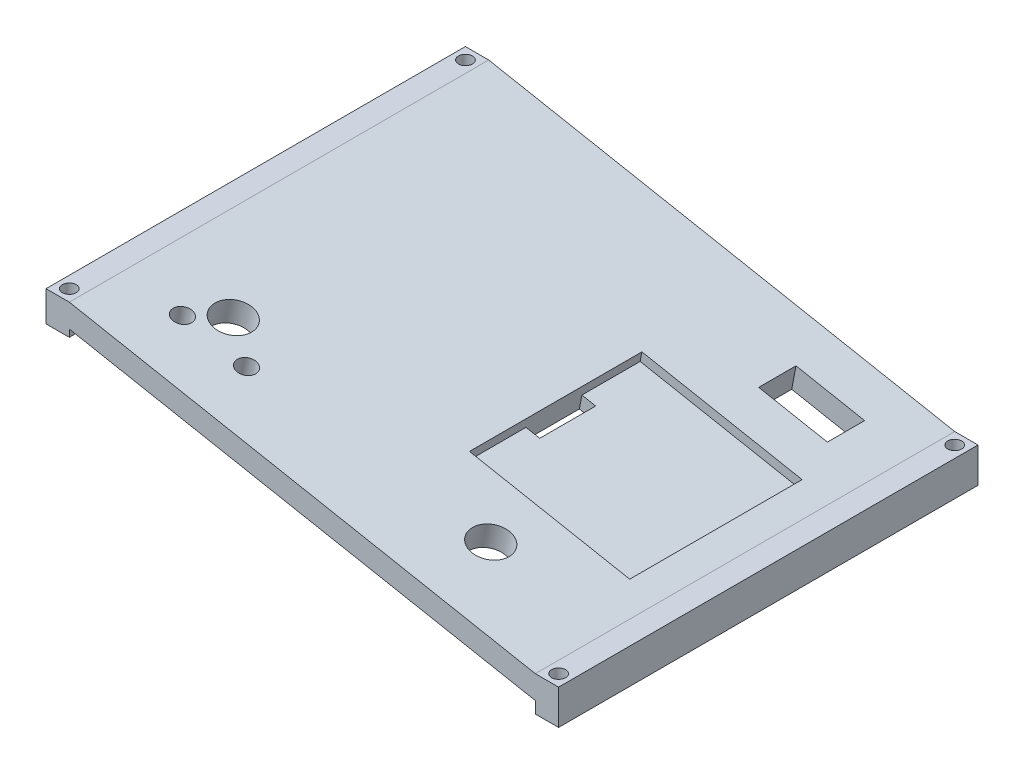
ISO-10303-21;
HEADER;
FILE_DESCRIPTION(('STEP AP214'),'2;1');
FILE_NAME('part.step','',(''),(''),'','','');
FILE_SCHEMA(('AUTOMOTIVE_DESIGN { 1 0 10303 214 1 1 1 1 }'));
ENDSEC;
DATA;
#1=APPLICATION_CONTEXT('core data for automotive mechanical design processes');
#2=APPLICATION_PROTOCOL_DEFINITION('international standard','automotive_design',2000,#1);
#3=PRODUCT_CONTEXT('',#1,'mechanical');
#4=PRODUCT('Part','Part','',(#3));
#5=PRODUCT_RELATED_PRODUCT_CATEGORY('part','',(#4));
#6=PRODUCT_DEFINITION_FORMATION('','',#4);
#7=PRODUCT_DEFINITION_CONTEXT('part definition',#1,'design');
#8=PRODUCT_DEFINITION('design','',#6,#7);
#9=PRODUCT_DEFINITION_SHAPE('','',#8);
#10=(LENGTH_UNIT() NAMED_UNIT(*) SI_UNIT(.MILLI.,.METRE.));
#11=(NAMED_UNIT(*) PLANE_ANGLE_UNIT() SI_UNIT($,.RADIAN.));
#12=(NAMED_UNIT(*) SI_UNIT($,.STERADIAN.) SOLID_ANGLE_UNIT());
#13=UNCERTAINTY_MEASURE_WITH_UNIT(LENGTH_MEASURE(1.E-05),#10,'distance_accuracy_value','');
#14=(GEOMETRIC_REPRESENTATION_CONTEXT(3) GLOBAL_UNCERTAINTY_ASSIGNED_CONTEXT((#13)) GLOBAL_UNIT_ASSIGNED_CONTEXT((#10,
#11,#12)) REPRESENTATION_CONTEXT('',''));
#15=CARTESIAN_POINT('',(0.,0.,0.));
#16=DIRECTION('',(0.,0.,1.));
#17=DIRECTION('',(1.,0.,0.));
#18=AXIS2_PLACEMENT_3D('',#15,#16,#17);
#19=CARTESIAN_POINT('',(3.12910284463895,16.4277899343545,-45.));
#20=DIRECTION('',(-0.187112107889995,-0.982338566422475,0.));
#21=DIRECTION('',(0.982338566422475,-0.187112107889995,0.));
#22=AXIS2_PLACEMENT_3D('',#19,#20,#21);
#23=PLANE('',#22);
#24=DIRECTION('',(0.982338566422475,-0.187112107889995,0.));
#25=VECTOR('',#24,1.);
#26=CARTESIAN_POINT('',(25.4415358394381,12.1778026972499,-27.5));
#27=LINE('',#26,#25);
#28=CARTESIAN_POINT('',(25.4415358394381,12.1778026972499,-27.5));
#29=VERTEX_POINT('',#28);
#30=CARTESIAN_POINT('',(40.1766143357753,9.37112107889996,-27.5));
#31=VERTEX_POINT('',#30);
#32=EDGE_CURVE('E232',#29,#31,#27,.T.);
#33=ORIENTED_EDGE('',*,*,#32,.F.);
#34=DIRECTION('',(0.,0.,1.));
#35=VECTOR('',#34,1.);
#36=CARTESIAN_POINT('',(25.4415358394381,12.1778026972499,-27.5));
#37=LINE('',#36,#35);
#38=CARTESIAN_POINT('',(25.4415358394381,12.1778026972499,-35.5));
#39=VERTEX_POINT('',#38);
#40=EDGE_CURVE('E87',#39,#29,#37,.T.);
#41=ORIENTED_EDGE('',*,*,#40,.F.);
#42=DIRECTION('',(-0.982338566422475,0.187112107889995,0.));
#43=VECTOR('',#42,1.);
#44=CARTESIAN_POINT('',(25.4415358394381,12.1778026972499,-35.5));
#45=LINE('',#44,#43);
#46=CARTESIAN_POINT('',(40.1766143357753,9.37112107889996,-35.5));
#47=VERTEX_POINT('',#46);
#48=EDGE_CURVE('E238',#47,#39,#45,.T.);
#49=ORIENTED_EDGE('',*,*,#48,.F.);
#50=DIRECTION('',(0.,0.,-1.));
#51=VECTOR('',#50,1.);
#52=CARTESIAN_POINT('',(40.1766143357753,9.37112107889996,-27.5));
#53=LINE('',#52,#51);
#54=EDGE_CURVE('E223',#31,#47,#53,.T.);
#55=ORIENTED_EDGE('',*,*,#54,.F.);
#56=EDGE_LOOP('',(#33,#41,#49,#55));
#57=FACE_BOUND('',#56,.T.);
#58=CARTESIAN_POINT('',(25.4415358394381,12.1778026972499,30.));
#59=DIRECTION('',(0.187112107889995,0.982338566422475,0.));
#60=DIRECTION('',(-0.982338566422475,0.187112107889995,0.));
#61=AXIS2_PLACEMENT_3D('',#58,#59,#60);
#62=CIRCLE('',#61,4.);
#63=CARTESIAN_POINT('',(21.5121815737482,12.9262511288099,30.));
#64=VERTEX_POINT('',#63);
#65=EDGE_CURVE('E245',#64,#64,#62,.T.);
#66=ORIENTED_EDGE('',*,*,#65,.F.);
#67=EDGE_LOOP('',(#66));
#68=FACE_BOUND('',#67,.T.);
#69=CARTESIAN_POINT('',(-23.9680279898044,21.5891481885342,33.));
#70=DIRECTION('',(0.187112107889995,0.982338566422475,0.));
#71=DIRECTION('',(-0.982338566422475,0.187112107889995,0.));
#72=AXIS2_PLACEMENT_3D('',#69,#70,#71);
#73=CIRCLE('',#72,2.);
#74=CARTESIAN_POINT('',(-25.9327051226494,21.9633724043142,33.));
#75=VERTEX_POINT('',#74);
#76=EDGE_CURVE('E255',#75,#75,#73,.T.);
#77=ORIENTED_EDGE('',*,*,#76,.F.);
#78=EDGE_LOOP('',(#77));
#79=FACE_BOUND('',#78,.T.);
#80=CARTESIAN_POINT('',(-32.8090750876067,23.2731571595441,27.));
#81=DIRECTION('',(0.187112107889995,0.982338566422475,0.));
#82=DIRECTION('',(-0.982338566422475,0.187112107889995,0.));
#83=AXIS2_PLACEMENT_3D('',#80,#81,#82);
#84=CIRCLE('',#83,4.);
#85=CARTESIAN_POINT('',(-36.7384293532966,24.0216055911041,27.));
#86=VERTEX_POINT('',#85);
#87=EDGE_CURVE('E251',#86,#86,#84,.T.);
#88=ORIENTED_EDGE('',*,*,#87,.F.);
#89=EDGE_LOOP('',(#88));
#90=FACE_BOUND('',#89,.T.);
#91=CARTESIAN_POINT('',(-37.7207679197191,24.2087176989941,33.));
#92=DIRECTION('',(0.187112107889995,0.982338566422475,0.));
#93=DIRECTION('',(-0.982338566422475,0.187112107889995,0.));
#94=AXIS2_PLACEMENT_3D('',#91,#92,#93);
#95=CIRCLE('',#94,2.);
#96=CARTESIAN_POINT('',(-39.685445052564,24.5829419147741,33.));
#97=VERTEX_POINT('',#96);
#98=EDGE_CURVE('E254',#97,#97,#95,.T.);
#99=ORIENTED_EDGE('',*,*,#98,.F.);
#100=EDGE_LOOP('',(#99));
#101=FACE_BOUND('',#100,.T.);
#102=DIRECTION('',(0.982338566422475,-0.187112107889995,0.));
#103=VECTOR('',#102,1.);
#104=CARTESIAN_POINT('',(3.12910284463895,16.4277899343545,45.));
#105=LINE('',#104,#103);
#106=CARTESIAN_POINT('',(-50.,26.547619047619,45.));
#107=VERTEX_POINT('',#106);
#108=CARTESIAN_POINT('',(50.,7.5,45.));
#109=VERTEX_POINT('',#108);
#110=EDGE_CURVE('E351',#107,#109,#105,.T.);
#111=ORIENTED_EDGE('',*,*,#110,.T.);
#112=DIRECTION('',(0.,0.,1.));
#113=VECTOR('',#112,1.);
#114=CARTESIAN_POINT('',(50.,7.5,-45.));
#115=LINE('',#114,#113);
#116=CARTESIAN_POINT('',(50.,7.5,-45.));
#117=VERTEX_POINT('',#116);
#118=EDGE_CURVE('E364',#117,#109,#115,.T.);
#119=ORIENTED_EDGE('',*,*,#118,.F.);
#120=DIRECTION('',(0.982338566422475,-0.187112107889995,0.));
#121=VECTOR('',#120,1.);
#122=CARTESIAN_POINT('',(3.12910284463895,16.4277899343545,-45.));
#123=LINE('',#122,#121);
#124=CARTESIAN_POINT('',(-50.,26.547619047619,-45.));
#125=VERTEX_POINT('',#124);
#126=EDGE_CURVE('E353',#125,#117,#123,.T.);
#127=ORIENTED_EDGE('',*,*,#126,.F.);
#128=DIRECTION('',(0.,0.,1.));
#129=VECTOR('',#128,1.);
#130=CARTESIAN_POINT('',(-50.,26.547619047619,-45.));
#131=LINE('',#130,#129);
#132=EDGE_CURVE('E367',#125,#107,#131,.T.);
#133=ORIENTED_EDGE('',*,*,#132,.T.);
#134=EDGE_LOOP('',(#111,#119,#127,#133));
#135=FACE_BOUND('',#134,.T.);
#136=DIRECTION('',(0.,0.,-1.));
#137=VECTOR('',#136,1.);
#138=CARTESIAN_POINT('',(9.37362650992617,15.2383568552522,0.));
#139=LINE('',#138,#137);
#140=CARTESIAN_POINT('',(9.37362650992617,15.2383568552522,18.5));
#141=VERTEX_POINT('',#140);
#142=CARTESIAN_POINT('',(9.37362650992617,15.2383568552522,-18.5));
#143=VERTEX_POINT('',#142);
#144=EDGE_CURVE('E289',#141,#143,#139,.T.);
#145=ORIENTED_EDGE('',*,*,#144,.T.);
#146=DIRECTION('',(0.982338566422475,-0.187112107889995,0.));
#147=VECTOR('',#146,1.);
#148=CARTESIAN_POINT('',(3.12910284463895,16.4277899343545,-18.5));
#149=LINE('',#148,#147);
#150=CARTESIAN_POINT('',(43.7554763347128,8.68943307910234,-18.5));
#151=VERTEX_POINT('',#150);
#152=EDGE_CURVE('E308',#143,#151,#149,.T.);
#153=ORIENTED_EDGE('',*,*,#152,.T.);
#154=DIRECTION('',(0.,0.,1.));
#155=VECTOR('',#154,1.);
#156=CARTESIAN_POINT('',(43.7554763347128,8.68943307910234,0.));
#157=LINE('',#156,#155);
#158=CARTESIAN_POINT('',(43.7554763347128,8.68943307910233,18.5));
#159=VERTEX_POINT('',#158);
#160=EDGE_CURVE('E305',#151,#159,#157,.T.);
#161=ORIENTED_EDGE('',*,*,#160,.T.);
#162=DIRECTION('',(-0.982338566422475,0.187112107889995,0.));
#163=VECTOR('',#162,1.);
#164=CARTESIAN_POINT('',(3.12910284463895,16.4277899343545,18.5));
#165=LINE('',#164,#163);
#166=EDGE_CURVE('E284',#159,#141,#165,.T.);
#167=ORIENTED_EDGE('',*,*,#166,.T.);
#168=EDGE_LOOP('',(#145,#153,#161,#167));
#169=FACE_BOUND('',#168,.T.);
#170=ADVANCED_FACE('F72',(#57,#68,#79,#90,#101,#135,#169),#23,.F.);
#171=CARTESIAN_POINT('',(2.21006564551422,11.6028446389497,-45.));
#172=DIRECTION('',(-0.187112107889995,-0.982338566422475,0.));
#173=DIRECTION('',(0.982338566422475,-0.187112107889995,0.));
#174=AXIS2_PLACEMENT_3D('',#171,#172,#173);
#175=PLANE('',#174);
#176=DIRECTION('',(0.,0.,-1.));
#177=VECTOR('',#176,1.);
#178=CARTESIAN_POINT('',(24.5224986403134,7.35285740184506,-45.));
#179=LINE('',#178,#177);
#180=CARTESIAN_POINT('',(24.5224986403134,7.35285740184506,-27.5));
#181=VERTEX_POINT('',#180);
#182=CARTESIAN_POINT('',(24.5224986403134,7.35285740184506,-35.5));
#183=VERTEX_POINT('',#182);
#184=EDGE_CURVE('E12',#181,#183,#179,.T.);
#185=ORIENTED_EDGE('',*,*,#184,.F.);
#186=DIRECTION('',(-0.982338566422475,0.187112107889995,0.));
#187=VECTOR('',#186,1.);
#188=CARTESIAN_POINT('',(2.21006564551422,11.6028446389497,-27.5));
#189=LINE('',#188,#187);
#190=CARTESIAN_POINT('',(39.2575771366505,4.54617578349514,-27.5));
#191=VERTEX_POINT('',#190);
#192=EDGE_CURVE('E424',#191,#181,#189,.T.);
#193=ORIENTED_EDGE('',*,*,#192,.F.);
#194=DIRECTION('',(0.,0.,1.));
#195=VECTOR('',#194,1.);
#196=CARTESIAN_POINT('',(39.2575771366505,4.54617578349514,-45.));
#197=LINE('',#196,#195);
#198=CARTESIAN_POINT('',(39.2575771366505,4.54617578349514,-35.5));
#199=VERTEX_POINT('',#198);
#200=EDGE_CURVE('E226',#199,#191,#197,.T.);
#201=ORIENTED_EDGE('',*,*,#200,.F.);
#202=DIRECTION('',(0.982338566422475,-0.187112107889995,0.));
#203=VECTOR('',#202,1.);
#204=CARTESIAN_POINT('',(2.21006564551422,11.6028446389497,-35.5));
#205=LINE('',#204,#203);
#206=EDGE_CURVE('E80',#183,#199,#205,.T.);
#207=ORIENTED_EDGE('',*,*,#206,.F.);
#208=EDGE_LOOP('',(#185,#193,#201,#207));
#209=FACE_BOUND('',#208,.T.);
#210=CARTESIAN_POINT('',(24.5224986403134,7.35285740184506,30.));
#211=DIRECTION('',(-0.187112107889995,-0.982338566422475,0.));
#212=DIRECTION('',(0.982338566422475,-0.187112107889995,0.));
#213=AXIS2_PLACEMENT_3D('',#210,#211,#212);
#214=CIRCLE('',#213,4.);
#215=CARTESIAN_POINT('',(28.4518529060033,6.60440897028508,30.));
#216=VERTEX_POINT('',#215);
#217=EDGE_CURVE('E250',#216,#216,#214,.T.);
#218=ORIENTED_EDGE('',*,*,#217,.F.);
#219=EDGE_LOOP('',(#218));
#220=FACE_BOUND('',#219,.T.);
#221=CARTESIAN_POINT('',(-24.8870651889291,16.7642028931294,33.));
#222=DIRECTION('',(-0.187112107889995,-0.982338566422475,0.));
#223=DIRECTION('',(0.982338566422475,-0.187112107889995,0.));
#224=AXIS2_PLACEMENT_3D('',#221,#222,#223);
#225=CIRCLE('',#224,2.);
#226=CARTESIAN_POINT('',(-22.9223880560842,16.3899786773494,33.));
#227=VERTEX_POINT('',#226);
#228=EDGE_CURVE('E273',#227,#227,#225,.T.);
#229=ORIENTED_EDGE('',*,*,#228,.F.);
#230=EDGE_LOOP('',(#229));
#231=FACE_BOUND('',#230,.T.);
#232=CARTESIAN_POINT('',(-33.7281122867314,18.4482118641393,27.));
#233=DIRECTION('',(-0.187112107889995,-0.982338566422475,0.));
#234=DIRECTION('',(0.982338566422475,-0.187112107889995,0.));
#235=AXIS2_PLACEMENT_3D('',#232,#233,#234);
#236=CIRCLE('',#235,4.);
#237=CARTESIAN_POINT('',(-29.7987580210415,17.6997634325793,27.));
#238=VERTEX_POINT('',#237);
#239=EDGE_CURVE('E427',#238,#238,#236,.T.);
#240=ORIENTED_EDGE('',*,*,#239,.F.);
#241=EDGE_LOOP('',(#240));
#242=FACE_BOUND('',#241,.T.);
#243=CARTESIAN_POINT('',(-38.6398051188438,19.3837724035893,33.));
#244=DIRECTION('',(-0.187112107889995,-0.982338566422475,0.));
#245=DIRECTION('',(0.982338566422475,-0.187112107889995,0.));
#246=AXIS2_PLACEMENT_3D('',#243,#244,#245);
#247=CIRCLE('',#246,2.);
#248=CARTESIAN_POINT('',(-36.6751279859988,19.0095481878093,33.));
#249=VERTEX_POINT('',#248);
#250=EDGE_CURVE('E260',#249,#249,#247,.T.);
#251=ORIENTED_EDGE('',*,*,#250,.F.);
#252=EDGE_LOOP('',(#251));
#253=FACE_BOUND('',#252,.T.);
#254=DIRECTION('',(0.982338566422475,-0.187112107889995,0.));
#255=VECTOR('',#254,1.);
#256=CARTESIAN_POINT('',(2.21006564551422,11.6028446389497,45.));
#257=LINE('',#256,#255);
#258=CARTESIAN_POINT('',(-50.,21.547619047619,45.));
#259=VERTEX_POINT('',#258);
#260=CARTESIAN_POINT('',(50.,2.5,45.));
#261=VERTEX_POINT('',#260);
#262=EDGE_CURVE('E366',#259,#261,#257,.T.);
#263=ORIENTED_EDGE('',*,*,#262,.F.);
#264=DIRECTION('',(0.,0.,1.));
#265=VECTOR('',#264,1.);
#266=CARTESIAN_POINT('',(-50.,21.547619047619,-45.));
#267=LINE('',#266,#265);
#268=CARTESIAN_POINT('',(-50.,21.547619047619,-45.));
#269=VERTEX_POINT('',#268);
#270=EDGE_CURVE('E384',#269,#259,#267,.T.);
#271=ORIENTED_EDGE('',*,*,#270,.F.);
#272=DIRECTION('',(0.982338566422475,-0.187112107889995,0.));
#273=VECTOR('',#272,1.);
#274=CARTESIAN_POINT('',(2.21006564551422,11.6028446389497,-45.));
#275=LINE('',#274,#273);
#276=CARTESIAN_POINT('',(50.,2.5,-45.));
#277=VERTEX_POINT('',#276);
#278=EDGE_CURVE('E373',#269,#277,#275,.T.);
#279=ORIENTED_EDGE('',*,*,#278,.T.);
#280=DIRECTION('',(0.,0.,1.));
#281=VECTOR('',#280,1.);
#282=CARTESIAN_POINT('',(50.,2.5,-45.));
#283=LINE('',#282,#281);
#284=EDGE_CURVE('E395',#277,#261,#283,.T.);
#285=ORIENTED_EDGE('',*,*,#284,.T.);
#286=EDGE_LOOP('',(#263,#271,#279,#285));
#287=FACE_BOUND('',#286,.T.);
#288=DIRECTION('',(0.,0.,1.));
#289=VECTOR('',#288,1.);
#290=CARTESIAN_POINT('',(11.4016050100689,9.85207523617736,-45.));
#291=LINE('',#290,#289);
#292=CARTESIAN_POINT('',(11.4016050100689,9.85207523617736,-6.));
#293=VERTEX_POINT('',#292);
#294=CARTESIAN_POINT('',(11.4016050100689,9.85207523617736,6.));
#295=VERTEX_POINT('',#294);
#296=EDGE_CURVE('E279',#293,#295,#291,.T.);
#297=ORIENTED_EDGE('',*,*,#296,.F.);
#298=DIRECTION('',(-0.982338566422475,0.187112107889995,0.));
#299=VECTOR('',#298,1.);
#300=CARTESIAN_POINT('',(2.21006564551422,11.6028446389497,-6.));
#301=LINE('',#300,#299);
#302=CARTESIAN_POINT('',(8.45458931080144,10.4134115598473,-6.));
#303=VERTEX_POINT('',#302);
#304=EDGE_CURVE('E281',#293,#303,#301,.T.);
#305=ORIENTED_EDGE('',*,*,#304,.T.);
#306=DIRECTION('',(0.,0.,1.));
#307=VECTOR('',#306,1.);
#308=CARTESIAN_POINT('',(8.45458931080144,10.4134115598473,-45.));
#309=LINE('',#308,#307);
#310=CARTESIAN_POINT('',(8.45458931080144,10.4134115598473,6.));
#311=VERTEX_POINT('',#310);
#312=EDGE_CURVE('E264',#303,#311,#309,.T.);
#313=ORIENTED_EDGE('',*,*,#312,.T.);
#314=DIRECTION('',(-0.982338566422475,0.187112107889995,0.));
#315=VECTOR('',#314,1.);
#316=CARTESIAN_POINT('',(2.21006564551422,11.6028446389497,6.));
#317=LINE('',#316,#315);
#318=EDGE_CURVE('E276',#295,#311,#317,.T.);
#319=ORIENTED_EDGE('',*,*,#318,.F.);
#320=EDGE_LOOP('',(#297,#305,#313,#319));
#321=FACE_BOUND('',#320,.T.);
#322=ADVANCED_FACE('F441',(#209,#220,#231,#242,#253,#287,#321),#175,.T.);
#323=CARTESIAN_POINT('',(55.,27.5,45.));
#324=DIRECTION('',(-1.,0.,0.));
#325=DIRECTION('',(0.,0.,1.));
#326=AXIS2_PLACEMENT_3D('',#323,#324,#325);
#327=PLANE('',#326);
#328=DIRECTION('',(0.,0.,1.));
#329=VECTOR('',#328,1.);
#330=CARTESIAN_POINT('',(55.,7.5,-45.));
#331=LINE('',#330,#329);
#332=CARTESIAN_POINT('',(55.,7.5,-45.));
#333=VERTEX_POINT('',#332);
#334=CARTESIAN_POINT('',(55.,7.5,45.));
#335=VERTEX_POINT('',#334);
#336=EDGE_CURVE('E356',#333,#335,#331,.T.);
#337=ORIENTED_EDGE('',*,*,#336,.T.);
#338=DIRECTION('',(0.,-1.,0.));
#339=VECTOR('',#338,1.);
#340=CARTESIAN_POINT('',(55.,27.5,45.));
#341=LINE('',#340,#339);
#342=CARTESIAN_POINT('',(55.,0.,45.));
#343=VERTEX_POINT('',#342);
#344=EDGE_CURVE('E414',#335,#343,#341,.T.);
#345=ORIENTED_EDGE('',*,*,#344,.T.);
#346=DIRECTION('',(0.,0.,-1.));
#347=VECTOR('',#346,1.);
#348=CARTESIAN_POINT('',(55.,0.,45.));
#349=LINE('',#348,#347);
#350=CARTESIAN_POINT('',(55.,0.,-45.));
#351=VERTEX_POINT('',#350);
#352=EDGE_CURVE('E397',#343,#351,#349,.T.);
#353=ORIENTED_EDGE('',*,*,#352,.T.);
#354=DIRECTION('',(0.,-1.,0.));
#355=VECTOR('',#354,1.);
#356=CARTESIAN_POINT('',(55.,27.5,-45.));
#357=LINE('',#356,#355);
#358=EDGE_CURVE('E422',#333,#351,#357,.T.);
#359=ORIENTED_EDGE('',*,*,#358,.F.);
#360=EDGE_LOOP('',(#337,#345,#353,#359));
#361=FACE_BOUND('',#360,.T.);
#362=ADVANCED_FACE('F74',(#361),#327,.F.);
#363=CARTESIAN_POINT('',(-55.,27.5,-45.));
#364=DIRECTION('',(0.,0.,1.));
#365=DIRECTION('',(1.,0.,0.));
#366=AXIS2_PLACEMENT_3D('',#363,#364,#365);
#367=PLANE('',#366);
#368=DIRECTION('',(-1.,0.,0.));
#369=VECTOR('',#368,1.);
#370=CARTESIAN_POINT('',(0.,7.49999999999999,-45.));
#371=LINE('',#370,#369);
#372=EDGE_CURVE('E348',#333,#117,#371,.T.);
#373=ORIENTED_EDGE('',*,*,#372,.F.);
#374=ORIENTED_EDGE('',*,*,#358,.T.);
#375=DIRECTION('',(-1.,0.,0.));
#376=VECTOR('',#375,1.);
#377=CARTESIAN_POINT('',(-55.,0.,-45.));
#378=LINE('',#377,#376);
#379=CARTESIAN_POINT('',(50.,0.,-45.));
#380=VERTEX_POINT('',#379);
#381=EDGE_CURVE('E408',#351,#380,#378,.T.);
#382=ORIENTED_EDGE('',*,*,#381,.T.);
#383=DIRECTION('',(0.,1.,0.));
#384=VECTOR('',#383,1.);
#385=CARTESIAN_POINT('',(50.,0.,-45.));
#386=LINE('',#385,#384);
#387=EDGE_CURVE('E381',#380,#277,#386,.T.);
#388=ORIENTED_EDGE('',*,*,#387,.T.);
#389=ORIENTED_EDGE('',*,*,#278,.F.);
#390=DIRECTION('',(0.,-1.,0.));
#391=VECTOR('',#390,1.);
#392=CARTESIAN_POINT('',(-50.,0.,-45.));
#393=LINE('',#392,#391);
#394=CARTESIAN_POINT('',(-50.,20.,-45.));
#395=VERTEX_POINT('',#394);
#396=EDGE_CURVE('E375',#269,#395,#393,.T.);
#397=ORIENTED_EDGE('',*,*,#396,.T.);
#398=DIRECTION('',(1.,0.,0.));
#399=VECTOR('',#398,1.);
#400=CARTESIAN_POINT('',(0.,20.,-45.));
#401=LINE('',#400,#399);
#402=CARTESIAN_POINT('',(-55.,20.,-45.));
#403=VERTEX_POINT('',#402);
#404=EDGE_CURVE('E379',#403,#395,#401,.T.);
#405=ORIENTED_EDGE('',*,*,#404,.F.);
#406=DIRECTION('',(0.,-1.,0.));
#407=VECTOR('',#406,1.);
#408=CARTESIAN_POINT('',(-55.,27.5,-45.));
#409=LINE('',#408,#407);
#410=CARTESIAN_POINT('',(-55.,26.547619047619,-45.));
#411=VERTEX_POINT('',#410);
#412=EDGE_CURVE('E419',#411,#403,#409,.T.);
#413=ORIENTED_EDGE('',*,*,#412,.F.);
#414=DIRECTION('',(-1.,0.,0.));
#415=VECTOR('',#414,1.);
#416=CARTESIAN_POINT('',(0.,26.547619047619,-45.));
#417=LINE('',#416,#415);
#418=EDGE_CURVE('E350',#125,#411,#417,.T.);
#419=ORIENTED_EDGE('',*,*,#418,.F.);
#420=ORIENTED_EDGE('',*,*,#126,.T.);
#421=EDGE_LOOP('',(#373,#374,#382,#388,#389,#397,#405,#413,#419,#420));
#422=FACE_BOUND('',#421,.T.);
#423=ADVANCED_FACE('F496',(#422),#367,.F.);
#424=CARTESIAN_POINT('',(-55.,27.5,45.));
#425=DIRECTION('',(1.,0.,0.));
#426=DIRECTION('',(0.,0.,-1.));
#427=AXIS2_PLACEMENT_3D('',#424,#425,#426);
#428=PLANE('',#427);
#429=DIRECTION('',(0.,0.,1.));
#430=VECTOR('',#429,1.);
#431=CARTESIAN_POINT('',(-55.,26.547619047619,-45.));
#432=LINE('',#431,#430);
#433=CARTESIAN_POINT('',(-55.,26.547619047619,45.));
#434=VERTEX_POINT('',#433);
#435=EDGE_CURVE('E369',#411,#434,#432,.T.);
#436=ORIENTED_EDGE('',*,*,#435,.F.);
#437=ORIENTED_EDGE('',*,*,#412,.T.);
#438=DIRECTION('',(0.,0.,1.));
#439=VECTOR('',#438,1.);
#440=CARTESIAN_POINT('',(-55.,20.,-45.));
#441=LINE('',#440,#439);
#442=CARTESIAN_POINT('',(-55.,20.,45.));
#443=VERTEX_POINT('',#442);
#444=EDGE_CURVE('E400',#403,#443,#441,.T.);
#445=ORIENTED_EDGE('',*,*,#444,.T.);
#446=DIRECTION('',(0.,-1.,0.));
#447=VECTOR('',#446,1.);
#448=CARTESIAN_POINT('',(-55.,27.5,45.));
#449=LINE('',#448,#447);
#450=EDGE_CURVE('E416',#434,#443,#449,.T.);
#451=ORIENTED_EDGE('',*,*,#450,.F.);
#452=EDGE_LOOP('',(#436,#437,#445,#451));
#453=FACE_BOUND('',#452,.T.);
#454=ADVANCED_FACE('F493',(#453),#428,.F.);
#455=CARTESIAN_POINT('',(-55.,27.5,45.));
#456=DIRECTION('',(0.,0.,-1.));
#457=DIRECTION('',(-1.,0.,0.));
#458=AXIS2_PLACEMENT_3D('',#455,#456,#457);
#459=PLANE('',#458);
#460=DIRECTION('',(-1.,0.,0.));
#461=VECTOR('',#460,1.);
#462=CARTESIAN_POINT('',(0.,7.49999999999999,45.));
#463=LINE('',#462,#461);
#464=EDGE_CURVE('E345',#335,#109,#463,.T.);
#465=ORIENTED_EDGE('',*,*,#464,.T.);
#466=ORIENTED_EDGE('',*,*,#110,.F.);
#467=DIRECTION('',(-1.,0.,0.));
#468=VECTOR('',#467,1.);
#469=CARTESIAN_POINT('',(0.,26.547619047619,45.));
#470=LINE('',#469,#468);
#471=EDGE_CURVE('E359',#107,#434,#470,.T.);
#472=ORIENTED_EDGE('',*,*,#471,.T.);
#473=ORIENTED_EDGE('',*,*,#450,.T.);
#474=DIRECTION('',(1.,0.,0.));
#475=VECTOR('',#474,1.);
#476=CARTESIAN_POINT('',(0.,20.,45.));
#477=LINE('',#476,#475);
#478=CARTESIAN_POINT('',(-50.,20.,45.));
#479=VERTEX_POINT('',#478);
#480=EDGE_CURVE('E390',#443,#479,#477,.T.);
#481=ORIENTED_EDGE('',*,*,#480,.T.);
#482=DIRECTION('',(0.,-1.,0.));
#483=VECTOR('',#482,1.);
#484=CARTESIAN_POINT('',(-50.,0.,45.));
#485=LINE('',#484,#483);
#486=EDGE_CURVE('E387',#259,#479,#485,.T.);
#487=ORIENTED_EDGE('',*,*,#486,.F.);
#488=ORIENTED_EDGE('',*,*,#262,.T.);
#489=DIRECTION('',(0.,1.,0.));
#490=VECTOR('',#489,1.);
#491=CARTESIAN_POINT('',(50.,0.,45.));
#492=LINE('',#491,#490);
#493=CARTESIAN_POINT('',(50.,0.,45.));
#494=VERTEX_POINT('',#493);
#495=EDGE_CURVE('E376',#494,#261,#492,.T.);
#496=ORIENTED_EDGE('',*,*,#495,.F.);
#497=DIRECTION('',(1.,0.,0.));
#498=VECTOR('',#497,1.);
#499=CARTESIAN_POINT('',(-55.,0.,45.));
#500=LINE('',#499,#498);
#501=EDGE_CURVE('E411',#494,#343,#500,.T.);
#502=ORIENTED_EDGE('',*,*,#501,.T.);
#503=ORIENTED_EDGE('',*,*,#344,.F.);
#504=EDGE_LOOP('',(#465,#466,#472,#473,#481,#487,#488,#496,#502,#503));
#505=FACE_BOUND('',#504,.T.);
#506=ADVANCED_FACE('F489',(#505),#459,.F.);
#507=CARTESIAN_POINT('',(0.,0.,0.));
#508=DIRECTION('',(0.,-1.,0.));
#509=DIRECTION('',(0.,0.,-1.));
#510=AXIS2_PLACEMENT_3D('',#507,#508,#509);
#511=PLANE('',#510);
#512=CARTESIAN_POINT('',(52.5,0.,42.5));
#513=DIRECTION('',(0.,1.,0.));
#514=DIRECTION('',(-1.,0.,0.));
#515=AXIS2_PLACEMENT_3D('',#512,#513,#514);
#516=CIRCLE('',#515,1.5);
#517=CARTESIAN_POINT('',(51.,0.,42.5));
#518=VERTEX_POINT('',#517);
#519=EDGE_CURVE('E336',#518,#518,#516,.T.);
#520=ORIENTED_EDGE('',*,*,#519,.T.);
#521=EDGE_LOOP('',(#520));
#522=FACE_BOUND('',#521,.T.);
#523=CARTESIAN_POINT('',(52.5,0.,-42.5));
#524=DIRECTION('',(0.,1.,0.));
#525=DIRECTION('',(-1.,0.,0.));
#526=AXIS2_PLACEMENT_3D('',#523,#524,#525);
#527=CIRCLE('',#526,1.5);
#528=CARTESIAN_POINT('',(51.,0.,-42.5));
#529=VERTEX_POINT('',#528);
#530=EDGE_CURVE('E342',#529,#529,#527,.T.);
#531=ORIENTED_EDGE('',*,*,#530,.T.);
#532=EDGE_LOOP('',(#531));
#533=FACE_BOUND('',#532,.T.);
#534=DIRECTION('',(0.,0.,1.));
#535=VECTOR('',#534,1.);
#536=CARTESIAN_POINT('',(50.,0.,-45.));
#537=LINE('',#536,#535);
#538=EDGE_CURVE('E398',#380,#494,#537,.T.);
#539=ORIENTED_EDGE('',*,*,#538,.F.);
#540=ORIENTED_EDGE('',*,*,#381,.F.);
#541=ORIENTED_EDGE('',*,*,#352,.F.);
#542=ORIENTED_EDGE('',*,*,#501,.F.);
#543=EDGE_LOOP('',(#539,#540,#541,#542));
#544=FACE_BOUND('',#543,.T.);
#545=ADVANCED_FACE('F479',(#522,#533,#544),#511,.T.);
#546=CARTESIAN_POINT('',(50.,0.,-45.));
#547=DIRECTION('',(1.,0.,0.));
#548=DIRECTION('',(0.,0.,-1.));
#549=AXIS2_PLACEMENT_3D('',#546,#547,#548);
#550=PLANE('',#549);
#551=ORIENTED_EDGE('',*,*,#495,.T.);
#552=ORIENTED_EDGE('',*,*,#284,.F.);
#553=ORIENTED_EDGE('',*,*,#387,.F.);
#554=ORIENTED_EDGE('',*,*,#538,.T.);
#555=EDGE_LOOP('',(#551,#552,#553,#554));
#556=FACE_BOUND('',#555,.T.);
#557=ADVANCED_FACE('F475',(#556),#550,.F.);
#558=CARTESIAN_POINT('',(0.,20.,-45.));
#559=DIRECTION('',(0.,-1.,0.));
#560=DIRECTION('',(0.,0.,-1.));
#561=AXIS2_PLACEMENT_3D('',#558,#559,#560);
#562=PLANE('',#561);
#563=CARTESIAN_POINT('',(-52.5,20.,42.5));
#564=DIRECTION('',(0.,-1.,0.));
#565=DIRECTION('',(0.,0.,-1.));
#566=AXIS2_PLACEMENT_3D('',#563,#564,#565);
#567=CIRCLE('',#566,1.5);
#568=CARTESIAN_POINT('',(-52.5,20.,41.));
#569=VERTEX_POINT('',#568);
#570=EDGE_CURVE('E326',#569,#569,#567,.T.);
#571=ORIENTED_EDGE('',*,*,#570,.F.);
#572=EDGE_LOOP('',(#571));
#573=FACE_BOUND('',#572,.T.);
#574=CARTESIAN_POINT('',(-52.5,20.,-42.5));
#575=DIRECTION('',(0.,-1.,0.));
#576=DIRECTION('',(0.,0.,-1.));
#577=AXIS2_PLACEMENT_3D('',#574,#575,#576);
#578=CIRCLE('',#577,1.5);
#579=CARTESIAN_POINT('',(-52.5,20.,-44.));
#580=VERTEX_POINT('',#579);
#581=EDGE_CURVE('E332',#580,#580,#578,.T.);
#582=ORIENTED_EDGE('',*,*,#581,.F.);
#583=EDGE_LOOP('',(#582));
#584=FACE_BOUND('',#583,.T.);
#585=ORIENTED_EDGE('',*,*,#480,.F.);
#586=ORIENTED_EDGE('',*,*,#444,.F.);
#587=ORIENTED_EDGE('',*,*,#404,.T.);
#588=DIRECTION('',(0.,0.,1.));
#589=VECTOR('',#588,1.);
#590=CARTESIAN_POINT('',(-50.,20.,-45.));
#591=LINE('',#590,#589);
#592=EDGE_CURVE('E403',#395,#479,#591,.T.);
#593=ORIENTED_EDGE('',*,*,#592,.T.);
#594=EDGE_LOOP('',(#585,#586,#587,#593));
#595=FACE_BOUND('',#594,.T.);
#596=ADVANCED_FACE('F478',(#573,#584,#595),#562,.T.);
#597=CARTESIAN_POINT('',(-50.,0.,-45.));
#598=DIRECTION('',(-1.,0.,0.));
#599=DIRECTION('',(0.,0.,1.));
#600=AXIS2_PLACEMENT_3D('',#597,#598,#599);
#601=PLANE('',#600);
#602=ORIENTED_EDGE('',*,*,#486,.T.);
#603=ORIENTED_EDGE('',*,*,#592,.F.);
#604=ORIENTED_EDGE('',*,*,#396,.F.);
#605=ORIENTED_EDGE('',*,*,#270,.T.);
#606=EDGE_LOOP('',(#602,#603,#604,#605));
#607=FACE_BOUND('',#606,.T.);
#608=ADVANCED_FACE('F473',(#607),#601,.F.);
#609=CARTESIAN_POINT('',(0.,7.49999999999999,-45.));
#610=DIRECTION('',(0.,1.,0.));
#611=DIRECTION('',(-1.,0.,0.));
#612=AXIS2_PLACEMENT_3D('',#609,#610,#611);
#613=PLANE('',#612);
#614=CARTESIAN_POINT('',(52.5,7.5,42.5));
#615=DIRECTION('',(0.,1.,0.));
#616=DIRECTION('',(-1.,0.,0.));
#617=AXIS2_PLACEMENT_3D('',#614,#615,#616);
#618=CIRCLE('',#617,1.5);
#619=CARTESIAN_POINT('',(51.,7.5,42.5));
#620=VERTEX_POINT('',#619);
#621=EDGE_CURVE('E335',#620,#620,#618,.T.);
#622=ORIENTED_EDGE('',*,*,#621,.F.);
#623=EDGE_LOOP('',(#622));
#624=FACE_BOUND('',#623,.T.);
#625=CARTESIAN_POINT('',(52.5,7.5,-42.5));
#626=DIRECTION('',(0.,1.,0.));
#627=DIRECTION('',(-1.,0.,0.));
#628=AXIS2_PLACEMENT_3D('',#625,#626,#627);
#629=CIRCLE('',#628,1.5);
#630=CARTESIAN_POINT('',(51.,7.5,-42.5));
#631=VERTEX_POINT('',#630);
#632=EDGE_CURVE('E339',#631,#631,#629,.T.);
#633=ORIENTED_EDGE('',*,*,#632,.F.);
#634=EDGE_LOOP('',(#633));
#635=FACE_BOUND('',#634,.T.);
#636=ORIENTED_EDGE('',*,*,#464,.F.);
#637=ORIENTED_EDGE('',*,*,#336,.F.);
#638=ORIENTED_EDGE('',*,*,#372,.T.);
#639=ORIENTED_EDGE('',*,*,#118,.T.);
#640=EDGE_LOOP('',(#636,#637,#638,#639));
#641=FACE_BOUND('',#640,.T.);
#642=ADVANCED_FACE('F469',(#624,#635,#641),#613,.T.);
#643=CARTESIAN_POINT('',(0.,26.547619047619,-45.));
#644=DIRECTION('',(0.,1.,0.));
#645=DIRECTION('',(0.,0.,1.));
#646=AXIS2_PLACEMENT_3D('',#643,#644,#645);
#647=PLANE('',#646);
#648=CARTESIAN_POINT('',(-52.5,26.547619047619,42.5));
#649=DIRECTION('',(0.,1.,0.));
#650=DIRECTION('',(0.,0.,1.));
#651=AXIS2_PLACEMENT_3D('',#648,#649,#650);
#652=CIRCLE('',#651,1.5);
#653=CARTESIAN_POINT('',(-52.5,26.547619047619,44.));
#654=VERTEX_POINT('',#653);
#655=EDGE_CURVE('E315',#654,#654,#652,.T.);
#656=ORIENTED_EDGE('',*,*,#655,.F.);
#657=EDGE_LOOP('',(#656));
#658=FACE_BOUND('',#657,.T.);
#659=CARTESIAN_POINT('',(-52.5,26.547619047619,-42.5));
#660=DIRECTION('',(0.,1.,0.));
#661=DIRECTION('',(0.,0.,1.));
#662=AXIS2_PLACEMENT_3D('',#659,#660,#661);
#663=CIRCLE('',#662,1.5);
#664=CARTESIAN_POINT('',(-52.5,26.547619047619,-41.));
#665=VERTEX_POINT('',#664);
#666=EDGE_CURVE('E329',#665,#665,#663,.T.);
#667=ORIENTED_EDGE('',*,*,#666,.F.);
#668=EDGE_LOOP('',(#667));
#669=FACE_BOUND('',#668,.T.);
#670=ORIENTED_EDGE('',*,*,#471,.F.);
#671=ORIENTED_EDGE('',*,*,#132,.F.);
#672=ORIENTED_EDGE('',*,*,#418,.T.);
#673=ORIENTED_EDGE('',*,*,#435,.T.);
#674=EDGE_LOOP('',(#670,#671,#672,#673));
#675=FACE_BOUND('',#674,.T.);
#676=ADVANCED_FACE('F466',(#658,#669,#675),#647,.T.);
#677=CARTESIAN_POINT('',(52.5,0.,-42.5));
#678=DIRECTION('',(0.,1.,0.));
#679=DIRECTION('',(-1.,0.,0.));
#680=AXIS2_PLACEMENT_3D('',#677,#678,#679);
#681=CYLINDRICAL_SURFACE('',#680,1.5);
#682=ORIENTED_EDGE('',*,*,#530,.F.);
#683=EDGE_LOOP('',(#682));
#684=FACE_BOUND('',#683,.T.);
#685=ORIENTED_EDGE('',*,*,#632,.T.);
#686=EDGE_LOOP('',(#685));
#687=FACE_BOUND('',#686,.T.);
#688=ADVANCED_FACE('F464',(#684,#687),#681,.F.);
#689=CARTESIAN_POINT('',(52.5,0.,42.5));
#690=DIRECTION('',(0.,1.,0.));
#691=DIRECTION('',(-1.,0.,0.));
#692=AXIS2_PLACEMENT_3D('',#689,#690,#691);
#693=CYLINDRICAL_SURFACE('',#692,1.5);
#694=ORIENTED_EDGE('',*,*,#519,.F.);
#695=EDGE_LOOP('',(#694));
#696=FACE_BOUND('',#695,.T.);
#697=ORIENTED_EDGE('',*,*,#621,.T.);
#698=EDGE_LOOP('',(#697));
#699=FACE_BOUND('',#698,.T.);
#700=ADVANCED_FACE('F597',(#696,#699),#693,.F.);
#701=CARTESIAN_POINT('',(-52.5,19.0476190476191,-42.5));
#702=DIRECTION('',(0.,1.,0.));
#703=DIRECTION('',(0.,0.,1.));
#704=AXIS2_PLACEMENT_3D('',#701,#702,#703);
#705=CYLINDRICAL_SURFACE('',#704,1.5);
#706=ORIENTED_EDGE('',*,*,#581,.T.);
#707=EDGE_LOOP('',(#706));
#708=FACE_BOUND('',#707,.T.);
#709=ORIENTED_EDGE('',*,*,#666,.T.);
#710=EDGE_LOOP('',(#709));
#711=FACE_BOUND('',#710,.T.);
#712=ADVANCED_FACE('F594',(#708,#711),#705,.F.);
#713=CARTESIAN_POINT('',(-52.5,19.0476190476191,42.5));
#714=DIRECTION('',(0.,1.,0.));
#715=DIRECTION('',(0.,0.,1.));
#716=AXIS2_PLACEMENT_3D('',#713,#714,#715);
#717=CYLINDRICAL_SURFACE('',#716,1.5);
#718=ORIENTED_EDGE('',*,*,#570,.T.);
#719=EDGE_LOOP('',(#718));
#720=FACE_BOUND('',#719,.T.);
#721=ORIENTED_EDGE('',*,*,#655,.T.);
#722=EDGE_LOOP('',(#721));
#723=FACE_BOUND('',#722,.T.);
#724=ADVANCED_FACE('F591',(#720,#723),#717,.F.);
#725=CARTESIAN_POINT('',(2.75487862885896,14.4631128015096,18.5));
#726=DIRECTION('',(0.,0.,-1.));
#727=DIRECTION('',(-1.,0.,0.));
#728=AXIS2_PLACEMENT_3D('',#725,#726,#727);
#729=PLANE('',#728);
#730=ORIENTED_EDGE('',*,*,#166,.F.);
#731=DIRECTION('',(0.187112107889995,0.982338566422475,0.));
#732=VECTOR('',#731,1.);
#733=CARTESIAN_POINT('',(43.3812521189328,6.72475594625739,18.5));
#734=LINE('',#733,#732);
#735=CARTESIAN_POINT('',(43.3812521189328,6.72475594625739,18.5));
#736=VERTEX_POINT('',#735);
#737=EDGE_CURVE('E321',#736,#159,#734,.T.);
#738=ORIENTED_EDGE('',*,*,#737,.F.);
#739=DIRECTION('',(-0.982338566422475,0.187112107889995,0.));
#740=VECTOR('',#739,1.);
#741=CARTESIAN_POINT('',(2.75487862885896,14.4631128015096,18.5));
#742=LINE('',#741,#740);
#743=CARTESIAN_POINT('',(8.99940229414618,13.2736797224072,18.5));
#744=VERTEX_POINT('',#743);
#745=EDGE_CURVE('E285',#736,#744,#742,.T.);
#746=ORIENTED_EDGE('',*,*,#745,.T.);
#747=DIRECTION('',(0.187112107889995,0.982338566422475,0.));
#748=VECTOR('',#747,1.);
#749=CARTESIAN_POINT('',(8.99940229414618,13.2736797224072,18.5));
#750=LINE('',#749,#748);
#751=EDGE_CURVE('E312',#744,#141,#750,.T.);
#752=ORIENTED_EDGE('',*,*,#751,.T.);
#753=EDGE_LOOP('',(#730,#738,#746,#752));
#754=FACE_BOUND('',#753,.T.);
#755=ADVANCED_FACE('F552',(#754),#729,.T.);
#756=CARTESIAN_POINT('',(8.99940229414618,13.2736797224072,0.));
#757=DIRECTION('',(0.982338566422475,-0.187112107889995,0.));
#758=DIRECTION('',(0.187112107889995,0.982338566422475,0.));
#759=AXIS2_PLACEMENT_3D('',#756,#757,#758);
#760=PLANE('',#759);
#761=ORIENTED_EDGE('',*,*,#144,.F.);
#762=ORIENTED_EDGE('',*,*,#751,.F.);
#763=DIRECTION('',(0.,0.,-1.));
#764=VECTOR('',#763,1.);
#765=CARTESIAN_POINT('',(8.99940229414618,13.2736797224072,0.));
#766=LINE('',#765,#764);
#767=CARTESIAN_POINT('',(8.99940229414618,13.2736797224072,6.));
#768=VERTEX_POINT('',#767);
#769=EDGE_CURVE('E296',#744,#768,#766,.T.);
#770=ORIENTED_EDGE('',*,*,#769,.T.);
#771=DIRECTION('',(0.187112107889995,0.982338566422475,0.));
#772=VECTOR('',#771,1.);
#773=CARTESIAN_POINT('',(8.4380659704762,10.3266640231398,6.));
#774=LINE('',#773,#772);
#775=EDGE_CURVE('E268',#311,#768,#774,.T.);
#776=ORIENTED_EDGE('',*,*,#775,.F.);
#777=ORIENTED_EDGE('',*,*,#312,.F.);
#778=DIRECTION('',(0.187112107889995,0.982338566422475,0.));
#779=VECTOR('',#778,1.);
#780=CARTESIAN_POINT('',(8.4380659704762,10.3266640231398,-6.));
#781=LINE('',#780,#779);
#782=CARTESIAN_POINT('',(8.99940229414618,13.2736797224072,-6.));
#783=VERTEX_POINT('',#782);
#784=EDGE_CURVE('E270',#303,#783,#781,.T.);
#785=ORIENTED_EDGE('',*,*,#784,.T.);
#786=CARTESIAN_POINT('',(8.99940229414618,13.2736797224072,-18.5));
#787=VERTEX_POINT('',#786);
#788=EDGE_CURVE('E293',#783,#787,#766,.T.);
#789=ORIENTED_EDGE('',*,*,#788,.T.);
#790=DIRECTION('',(0.187112107889995,0.982338566422475,0.));
#791=VECTOR('',#790,1.);
#792=CARTESIAN_POINT('',(8.99940229414618,13.2736797224072,-18.5));
#793=LINE('',#792,#791);
#794=EDGE_CURVE('E316',#787,#143,#793,.T.);
#795=ORIENTED_EDGE('',*,*,#794,.T.);
#796=EDGE_LOOP('',(#761,#762,#770,#776,#777,#785,#789,#795));
#797=FACE_BOUND('',#796,.T.);
#798=ADVANCED_FACE('F539',(#797),#760,.T.);
#799=CARTESIAN_POINT('',(2.75487862885896,14.4631128015096,-18.5));
#800=DIRECTION('',(0.,0.,1.));
#801=DIRECTION('',(1.,0.,0.));
#802=AXIS2_PLACEMENT_3D('',#799,#800,#801);
#803=PLANE('',#802);
#804=ORIENTED_EDGE('',*,*,#152,.F.);
#805=ORIENTED_EDGE('',*,*,#794,.F.);
#806=DIRECTION('',(0.982338566422475,-0.187112107889995,0.));
#807=VECTOR('',#806,1.);
#808=CARTESIAN_POINT('',(2.75487862885896,14.4631128015096,-18.5));
#809=LINE('',#808,#807);
#810=CARTESIAN_POINT('',(43.3812521189328,6.72475594625739,-18.5));
#811=VERTEX_POINT('',#810);
#812=EDGE_CURVE('E291',#787,#811,#809,.T.);
#813=ORIENTED_EDGE('',*,*,#812,.T.);
#814=DIRECTION('',(0.187112107889995,0.982338566422475,0.));
#815=VECTOR('',#814,1.);
#816=CARTESIAN_POINT('',(43.3812521189328,6.72475594625739,-18.5));
#817=LINE('',#816,#815);
#818=EDGE_CURVE('E319',#811,#151,#817,.T.);
#819=ORIENTED_EDGE('',*,*,#818,.T.);
#820=EDGE_LOOP('',(#804,#805,#813,#819));
#821=FACE_BOUND('',#820,.T.);
#822=ADVANCED_FACE('F543',(#821),#803,.T.);
#823=CARTESIAN_POINT('',(43.3812521189328,6.72475594625739,0.));
#824=DIRECTION('',(-0.982338566422475,0.187112107889995,0.));
#825=DIRECTION('',(-0.187112107889995,-0.982338566422475,0.));
#826=AXIS2_PLACEMENT_3D('',#823,#824,#825);
#827=PLANE('',#826);
#828=ORIENTED_EDGE('',*,*,#160,.F.);
#829=ORIENTED_EDGE('',*,*,#818,.F.);
#830=DIRECTION('',(0.,0.,1.));
#831=VECTOR('',#830,1.);
#832=CARTESIAN_POINT('',(43.3812521189328,6.72475594625739,0.));
#833=LINE('',#832,#831);
#834=EDGE_CURVE('E288',#811,#736,#833,.T.);
#835=ORIENTED_EDGE('',*,*,#834,.T.);
#836=ORIENTED_EDGE('',*,*,#737,.T.);
#837=EDGE_LOOP('',(#828,#829,#835,#836));
#838=FACE_BOUND('',#837,.T.);
#839=ADVANCED_FACE('F548',(#838),#827,.T.);
#840=CARTESIAN_POINT('',(2.75487862885896,14.4631128015096,0.));
#841=DIRECTION('',(0.187112107889995,0.982338566422475,0.));
#842=DIRECTION('',(-0.982338566422475,0.187112107889995,0.));
#843=AXIS2_PLACEMENT_3D('',#840,#841,#842);
#844=PLANE('',#843);
#845=ORIENTED_EDGE('',*,*,#745,.F.);
#846=ORIENTED_EDGE('',*,*,#834,.F.);
#847=ORIENTED_EDGE('',*,*,#812,.F.);
#848=ORIENTED_EDGE('',*,*,#788,.F.);
#849=DIRECTION('',(0.982338566422475,-0.187112107889995,0.));
#850=VECTOR('',#849,1.);
#851=CARTESIAN_POINT('',(2.75487862885896,14.4631128015096,-6.));
#852=LINE('',#851,#850);
#853=CARTESIAN_POINT('',(11.9464179934136,12.7123433987372,-6.));
#854=VERTEX_POINT('',#853);
#855=EDGE_CURVE('E295',#783,#854,#852,.T.);
#856=ORIENTED_EDGE('',*,*,#855,.T.);
#857=DIRECTION('',(0.,0.,-1.));
#858=VECTOR('',#857,1.);
#859=CARTESIAN_POINT('',(11.9464179934136,12.7123433987372,0.));
#860=LINE('',#859,#858);
#861=CARTESIAN_POINT('',(11.9464179934136,12.7123433987372,6.));
#862=VERTEX_POINT('',#861);
#863=EDGE_CURVE('E299',#862,#854,#860,.T.);
#864=ORIENTED_EDGE('',*,*,#863,.F.);
#865=DIRECTION('',(0.982338566422475,-0.187112107889995,0.));
#866=VECTOR('',#865,1.);
#867=CARTESIAN_POINT('',(2.75487862885896,14.4631128015096,6.));
#868=LINE('',#867,#866);
#869=EDGE_CURVE('E301',#768,#862,#868,.T.);
#870=ORIENTED_EDGE('',*,*,#869,.F.);
#871=ORIENTED_EDGE('',*,*,#769,.F.);
#872=EDGE_LOOP('',(#845,#846,#847,#848,#856,#864,#870,#871));
#873=FACE_BOUND('',#872,.T.);
#874=ADVANCED_FACE('F554',(#873),#844,.T.);
#875=CARTESIAN_POINT('',(2.19354230518898,11.5160971022421,-6.));
#876=DIRECTION('',(0.,0.,1.));
#877=DIRECTION('',(1.,0.,0.));
#878=AXIS2_PLACEMENT_3D('',#875,#876,#877);
#879=PLANE('',#878);
#880=DIRECTION('',(0.187112107889995,0.982338566422475,0.));
#881=VECTOR('',#880,1.);
#882=CARTESIAN_POINT('',(11.3850816697436,9.76532769946982,-6.));
#883=LINE('',#882,#881);
#884=EDGE_CURVE('E261',#293,#854,#883,.T.);
#885=ORIENTED_EDGE('',*,*,#884,.T.);
#886=ORIENTED_EDGE('',*,*,#855,.F.);
#887=ORIENTED_EDGE('',*,*,#784,.F.);
#888=ORIENTED_EDGE('',*,*,#304,.F.);
#889=EDGE_LOOP('',(#885,#886,#887,#888));
#890=FACE_BOUND('',#889,.T.);
#891=ADVANCED_FACE('F566',(#890),#879,.T.);
#892=CARTESIAN_POINT('',(11.3850816697436,9.76532769946982,0.));
#893=DIRECTION('',(0.982338566422475,-0.187112107889995,0.));
#894=DIRECTION('',(0.187112107889995,0.982338566422475,0.));
#895=AXIS2_PLACEMENT_3D('',#892,#893,#894);
#896=PLANE('',#895);
#897=ORIENTED_EDGE('',*,*,#296,.T.);
#898=DIRECTION('',(0.187112107889995,0.982338566422475,0.));
#899=VECTOR('',#898,1.);
#900=CARTESIAN_POINT('',(11.3850816697436,9.76532769946982,6.));
#901=LINE('',#900,#899);
#902=EDGE_CURVE('E265',#295,#862,#901,.T.);
#903=ORIENTED_EDGE('',*,*,#902,.T.);
#904=ORIENTED_EDGE('',*,*,#863,.T.);
#905=ORIENTED_EDGE('',*,*,#884,.F.);
#906=EDGE_LOOP('',(#897,#903,#904,#905));
#907=FACE_BOUND('',#906,.T.);
#908=ADVANCED_FACE('F568',(#907),#896,.F.);
#909=CARTESIAN_POINT('',(2.19354230518898,11.5160971022421,6.));
#910=DIRECTION('',(0.,0.,1.));
#911=DIRECTION('',(1.,0.,0.));
#912=AXIS2_PLACEMENT_3D('',#909,#910,#911);
#913=PLANE('',#912);
#914=ORIENTED_EDGE('',*,*,#318,.T.);
#915=ORIENTED_EDGE('',*,*,#775,.T.);
#916=ORIENTED_EDGE('',*,*,#869,.T.);
#917=ORIENTED_EDGE('',*,*,#902,.F.);
#918=EDGE_LOOP('',(#914,#915,#916,#917));
#919=FACE_BOUND('',#918,.T.);
#920=ADVANCED_FACE('F562',(#919),#913,.F.);
#921=CARTESIAN_POINT('',(-38.656328459169,19.2970248668817,33.));
#922=DIRECTION('',(0.187112107889995,0.982338566422475,0.));
#923=DIRECTION('',(-0.982338566422475,0.187112107889995,0.));
#924=AXIS2_PLACEMENT_3D('',#921,#922,#923);
#925=CYLINDRICAL_SURFACE('',#924,2.);
#926=ORIENTED_EDGE('',*,*,#250,.T.);
#927=EDGE_LOOP('',(#926));
#928=FACE_BOUND('',#927,.T.);
#929=ORIENTED_EDGE('',*,*,#98,.T.);
#930=EDGE_LOOP('',(#929));
#931=FACE_BOUND('',#930,.T.);
#932=ADVANCED_FACE('F575',(#928,#931),#925,.F.);
#933=CARTESIAN_POINT('',(-33.7446356270567,18.3614643274318,27.));
#934=DIRECTION('',(0.187112107889995,0.982338566422475,0.));
#935=DIRECTION('',(-0.982338566422475,0.187112107889995,0.));
#936=AXIS2_PLACEMENT_3D('',#933,#934,#935);
#937=CYLINDRICAL_SURFACE('',#936,4.);
#938=ORIENTED_EDGE('',*,*,#239,.T.);
#939=EDGE_LOOP('',(#938));
#940=FACE_BOUND('',#939,.T.);
#941=ORIENTED_EDGE('',*,*,#87,.T.);
#942=EDGE_LOOP('',(#941));
#943=FACE_BOUND('',#942,.T.);
#944=ADVANCED_FACE('F708',(#940,#943),#937,.F.);
#945=CARTESIAN_POINT('',(-24.9035885292544,16.6774553564218,33.));
#946=DIRECTION('',(0.187112107889995,0.982338566422475,0.));
#947=DIRECTION('',(-0.982338566422475,0.187112107889995,0.));
#948=AXIS2_PLACEMENT_3D('',#945,#946,#947);
#949=CYLINDRICAL_SURFACE('',#948,2.);
#950=ORIENTED_EDGE('',*,*,#228,.T.);
#951=EDGE_LOOP('',(#950));
#952=FACE_BOUND('',#951,.T.);
#953=ORIENTED_EDGE('',*,*,#76,.T.);
#954=EDGE_LOOP('',(#953));
#955=FACE_BOUND('',#954,.T.);
#956=ADVANCED_FACE('F452',(#952,#955),#949,.F.);
#957=CARTESIAN_POINT('',(24.5059752999882,7.26610986513752,30.));
#958=DIRECTION('',(0.187112107889995,0.982338566422475,0.));
#959=DIRECTION('',(-0.982338566422475,0.187112107889995,0.));
#960=AXIS2_PLACEMENT_3D('',#957,#958,#959);
#961=CYLINDRICAL_SURFACE('',#960,4.);
#962=ORIENTED_EDGE('',*,*,#217,.T.);
#963=EDGE_LOOP('',(#962));
#964=FACE_BOUND('',#963,.T.);
#965=ORIENTED_EDGE('',*,*,#65,.T.);
#966=EDGE_LOOP('',(#965));
#967=FACE_BOUND('',#966,.T.);
#968=ADVANCED_FACE('F445',(#964,#967),#961,.F.);
#969=CARTESIAN_POINT('',(24.5059752999882,7.26610986513751,-27.5));
#970=DIRECTION('',(-0.982338566422475,0.187112107889995,0.));
#971=DIRECTION('',(-0.187112107889995,-0.982338566422475,0.));
#972=AXIS2_PLACEMENT_3D('',#969,#970,#971);
#973=PLANE('',#972);
#974=ORIENTED_EDGE('',*,*,#184,.T.);
#975=DIRECTION('',(0.187112107889995,0.982338566422475,0.));
#976=VECTOR('',#975,1.);
#977=CARTESIAN_POINT('',(24.5059752999882,7.26610986513751,-35.5));
#978=LINE('',#977,#976);
#979=EDGE_CURVE('E243',#183,#39,#978,.T.);
#980=ORIENTED_EDGE('',*,*,#979,.T.);
#981=ORIENTED_EDGE('',*,*,#40,.T.);
#982=DIRECTION('',(0.187112107889995,0.982338566422475,0.));
#983=VECTOR('',#982,1.);
#984=CARTESIAN_POINT('',(24.5059752999882,7.26610986513751,-27.5));
#985=LINE('',#984,#983);
#986=EDGE_CURVE('E229',#181,#29,#985,.T.);
#987=ORIENTED_EDGE('',*,*,#986,.F.);
#988=EDGE_LOOP('',(#974,#980,#981,#987));
#989=FACE_BOUND('',#988,.T.);
#990=ADVANCED_FACE('F443',(#989),#973,.F.);
#991=CARTESIAN_POINT('',(24.5059752999882,7.26610986513751,-35.5));
#992=DIRECTION('',(0.,0.,-1.));
#993=DIRECTION('',(-1.,0.,0.));
#994=AXIS2_PLACEMENT_3D('',#991,#992,#993);
#995=PLANE('',#994);
#996=ORIENTED_EDGE('',*,*,#206,.T.);
#997=DIRECTION('',(0.187112107889995,0.982338566422475,0.));
#998=VECTOR('',#997,1.);
#999=CARTESIAN_POINT('',(39.2410537963253,4.45942824678759,-35.5));
#1000=LINE('',#999,#998);
#1001=EDGE_CURVE('E228',#199,#47,#1000,.T.);
#1002=ORIENTED_EDGE('',*,*,#1001,.T.);
#1003=ORIENTED_EDGE('',*,*,#48,.T.);
#1004=ORIENTED_EDGE('',*,*,#979,.F.);
#1005=EDGE_LOOP('',(#996,#1002,#1003,#1004));
#1006=FACE_BOUND('',#1005,.T.);
#1007=ADVANCED_FACE('F438',(#1006),#995,.F.);
#1008=CARTESIAN_POINT('',(39.2410537963253,4.45942824678759,-27.5));
#1009=DIRECTION('',(0.982338566422475,-0.187112107889995,0.));
#1010=DIRECTION('',(0.187112107889995,0.982338566422475,0.));
#1011=AXIS2_PLACEMENT_3D('',#1008,#1009,#1010);
#1012=PLANE('',#1011);
#1013=ORIENTED_EDGE('',*,*,#200,.T.);
#1014=DIRECTION('',(0.187112107889995,0.982338566422475,0.));
#1015=VECTOR('',#1014,1.);
#1016=CARTESIAN_POINT('',(39.2410537963253,4.45942824678759,-27.5));
#1017=LINE('',#1016,#1015);
#1018=EDGE_CURVE('E95',#191,#31,#1017,.T.);
#1019=ORIENTED_EDGE('',*,*,#1018,.T.);
#1020=ORIENTED_EDGE('',*,*,#54,.T.);
#1021=ORIENTED_EDGE('',*,*,#1001,.F.);
#1022=EDGE_LOOP('',(#1013,#1019,#1020,#1021));
#1023=FACE_BOUND('',#1022,.T.);
#1024=ADVANCED_FACE('F220',(#1023),#1012,.F.);
#1025=CARTESIAN_POINT('',(24.5059752999882,7.26610986513751,-27.5));
#1026=DIRECTION('',(0.,0.,1.));
#1027=DIRECTION('',(1.,0.,0.));
#1028=AXIS2_PLACEMENT_3D('',#1025,#1026,#1027);
#1029=PLANE('',#1028);
#1030=ORIENTED_EDGE('',*,*,#192,.T.);
#1031=ORIENTED_EDGE('',*,*,#986,.T.);
#1032=ORIENTED_EDGE('',*,*,#32,.T.);
#1033=ORIENTED_EDGE('',*,*,#1018,.F.);
#1034=EDGE_LOOP('',(#1030,#1031,#1032,#1033));
#1035=FACE_BOUND('',#1034,.T.);
#1036=ADVANCED_FACE('F233',(#1035),#1029,.F.);
#1037=CLOSED_SHELL('',(#170,#322,#362,#423,#454,#506,#545,#557,#596,#608,#642,#676,#688,#700,
#712,#724,#755,#798,#822,#839,#874,#891,#908,#920,#932,#944,#956,#968,#990,#1007,#1024,#1036));
#1038=MANIFOLD_SOLID_BREP('B2',#1037);
#1039=ADVANCED_BREP_SHAPE_REPRESENTATION('',(#18,#1038),#14);
#1040=SHAPE_DEFINITION_REPRESENTATION(#9,#1039);
ENDSEC;
END-ISO-10303-21;
